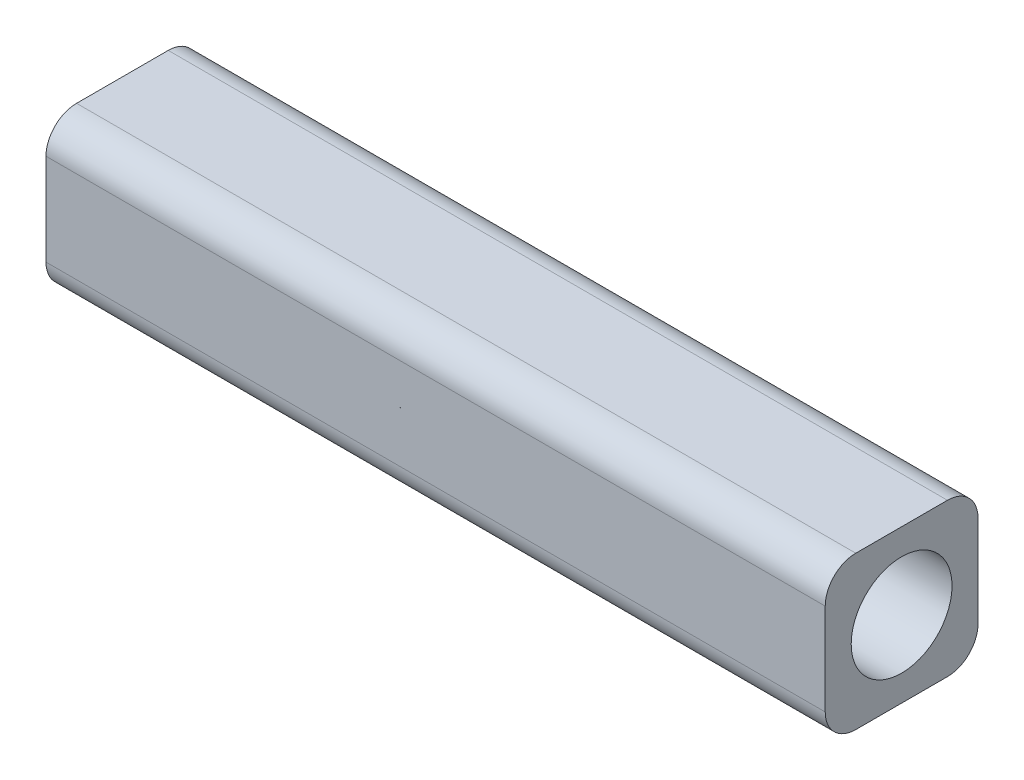
ISO-10303-21;
HEADER;
FILE_DESCRIPTION(('STEP AP214'),'2;1');
FILE_NAME('part.step','',(''),(''),'','','');
FILE_SCHEMA(('AUTOMOTIVE_DESIGN { 1 0 10303 214 1 1 1 1 }'));
ENDSEC;
DATA;
#1=APPLICATION_CONTEXT('core data for automotive mechanical design processes');
#2=APPLICATION_PROTOCOL_DEFINITION('international standard','automotive_design',2000,#1);
#3=PRODUCT_CONTEXT('',#1,'mechanical');
#4=PRODUCT('Part','Part','',(#3));
#5=PRODUCT_RELATED_PRODUCT_CATEGORY('part','',(#4));
#6=PRODUCT_DEFINITION_FORMATION('','',#4);
#7=PRODUCT_DEFINITION_CONTEXT('part definition',#1,'design');
#8=PRODUCT_DEFINITION('design','',#6,#7);
#9=PRODUCT_DEFINITION_SHAPE('','',#8);
#10=(LENGTH_UNIT() NAMED_UNIT(*) SI_UNIT(.MILLI.,.METRE.));
#11=(NAMED_UNIT(*) PLANE_ANGLE_UNIT() SI_UNIT($,.RADIAN.));
#12=(NAMED_UNIT(*) SI_UNIT($,.STERADIAN.) SOLID_ANGLE_UNIT());
#13=UNCERTAINTY_MEASURE_WITH_UNIT(LENGTH_MEASURE(1.E-05),#10,'distance_accuracy_value','');
#14=(GEOMETRIC_REPRESENTATION_CONTEXT(3) GLOBAL_UNCERTAINTY_ASSIGNED_CONTEXT((#13)) GLOBAL_UNIT_ASSIGNED_CONTEXT((#10,
#11,#12)) REPRESENTATION_CONTEXT('',''));
#15=CARTESIAN_POINT('',(0.,0.,0.));
#16=DIRECTION('',(0.,0.,1.));
#17=DIRECTION('',(1.,0.,0.));
#18=AXIS2_PLACEMENT_3D('',#15,#16,#17);
#19=CARTESIAN_POINT('',(12.75,5.,2.5));
#20=DIRECTION('',(-1.,0.,0.));
#21=DIRECTION('',(0.,0.,1.));
#22=AXIS2_PLACEMENT_3D('',#19,#20,#21);
#23=PLANE('',#22);
#24=CARTESIAN_POINT('',(12.75,2.5,0.));
#25=DIRECTION('',(-1.,0.,0.));
#26=DIRECTION('',(0.,0.,1.));
#27=AXIS2_PLACEMENT_3D('',#24,#25,#26);
#28=CIRCLE('',#27,1.65);
#29=CARTESIAN_POINT('',(12.75,2.5,1.65));
#30=VERTEX_POINT('',#29);
#31=EDGE_CURVE('E165',#30,#30,#28,.T.);
#32=ORIENTED_EDGE('',*,*,#31,.T.);
#33=EDGE_LOOP('',(#32));
#34=FACE_BOUND('',#33,.T.);
#35=DIRECTION('',(0.,0.,-1.));
#36=VECTOR('',#35,1.);
#37=CARTESIAN_POINT('',(12.75,0.,2.5));
#38=LINE('',#37,#36);
#39=CARTESIAN_POINT('',(12.75,0.,1.5));
#40=VERTEX_POINT('',#39);
#41=CARTESIAN_POINT('',(12.75,0.,-1.5));
#42=VERTEX_POINT('',#41);
#43=EDGE_CURVE('E162',#40,#42,#38,.T.);
#44=ORIENTED_EDGE('',*,*,#43,.T.);
#45=CARTESIAN_POINT('',(12.75,1.,-1.5));
#46=DIRECTION('',(-1.,0.,0.));
#47=DIRECTION('',(0.,0.,1.));
#48=AXIS2_PLACEMENT_3D('',#45,#46,#47);
#49=CIRCLE('',#48,1.);
#50=CARTESIAN_POINT('',(12.75,1.,-2.5));
#51=VERTEX_POINT('',#50);
#52=EDGE_CURVE('E143',#42,#51,#49,.F.);
#53=ORIENTED_EDGE('',*,*,#52,.T.);
#54=DIRECTION('',(0.,-1.,0.));
#55=VECTOR('',#54,1.);
#56=CARTESIAN_POINT('',(12.75,5.,-2.5));
#57=LINE('',#56,#55);
#58=CARTESIAN_POINT('',(12.75,4.,-2.5));
#59=VERTEX_POINT('',#58);
#60=EDGE_CURVE('E122',#59,#51,#57,.T.);
#61=ORIENTED_EDGE('',*,*,#60,.F.);
#62=CARTESIAN_POINT('',(12.75,4.,-1.5));
#63=DIRECTION('',(-1.,0.,0.));
#64=DIRECTION('',(0.,0.,1.));
#65=AXIS2_PLACEMENT_3D('',#62,#63,#64);
#66=CIRCLE('',#65,1.);
#67=CARTESIAN_POINT('',(12.75,5.,-1.5));
#68=VERTEX_POINT('',#67);
#69=EDGE_CURVE('E127',#59,#68,#66,.F.);
#70=ORIENTED_EDGE('',*,*,#69,.T.);
#71=DIRECTION('',(0.,0.,-1.));
#72=VECTOR('',#71,1.);
#73=CARTESIAN_POINT('',(12.75,5.,2.5));
#74=LINE('',#73,#72);
#75=CARTESIAN_POINT('',(12.75,5.,1.5));
#76=VERTEX_POINT('',#75);
#77=EDGE_CURVE('E153',#76,#68,#74,.T.);
#78=ORIENTED_EDGE('',*,*,#77,.F.);
#79=CARTESIAN_POINT('',(12.75,4.,1.5));
#80=DIRECTION('',(-1.,0.,0.));
#81=DIRECTION('',(0.,0.,1.));
#82=AXIS2_PLACEMENT_3D('',#79,#80,#81);
#83=CIRCLE('',#82,1.);
#84=CARTESIAN_POINT('',(12.75,4.,2.5));
#85=VERTEX_POINT('',#84);
#86=EDGE_CURVE('E58',#76,#85,#83,.F.);
#87=ORIENTED_EDGE('',*,*,#86,.T.);
#88=DIRECTION('',(0.,-1.,0.));
#89=VECTOR('',#88,1.);
#90=CARTESIAN_POINT('',(12.75,5.,2.5));
#91=LINE('',#90,#89);
#92=CARTESIAN_POINT('',(12.75,1.,2.5));
#93=VERTEX_POINT('',#92);
#94=EDGE_CURVE('E159',#85,#93,#91,.T.);
#95=ORIENTED_EDGE('',*,*,#94,.T.);
#96=CARTESIAN_POINT('',(12.75,1.,1.5));
#97=DIRECTION('',(-1.,0.,0.));
#98=DIRECTION('',(0.,0.,1.));
#99=AXIS2_PLACEMENT_3D('',#96,#97,#98);
#100=CIRCLE('',#99,1.);
#101=EDGE_CURVE('E50',#93,#40,#100,.F.);
#102=ORIENTED_EDGE('',*,*,#101,.T.);
#103=EDGE_LOOP('',(#44,#53,#61,#70,#78,#87,#95,#102));
#104=FACE_BOUND('',#103,.T.);
#105=ADVANCED_FACE('F35',(#34,#104),#23,.F.);
#106=CARTESIAN_POINT('',(-12.75,5.,-2.5));
#107=DIRECTION('',(0.,0.,1.));
#108=DIRECTION('',(1.,0.,0.));
#109=AXIS2_PLACEMENT_3D('',#106,#107,#108);
#110=PLANE('',#109);
#111=ORIENTED_EDGE('',*,*,#60,.T.);
#112=DIRECTION('',(-1.,0.,0.));
#113=VECTOR('',#112,1.);
#114=CARTESIAN_POINT('',(-12.75,1.,-2.5));
#115=LINE('',#114,#113);
#116=CARTESIAN_POINT('',(-12.75,1.,-2.5));
#117=VERTEX_POINT('',#116);
#118=EDGE_CURVE('E121',#51,#117,#115,.T.);
#119=ORIENTED_EDGE('',*,*,#118,.T.);
#120=DIRECTION('',(0.,-1.,0.));
#121=VECTOR('',#120,1.);
#122=CARTESIAN_POINT('',(-12.75,5.,-2.5));
#123=LINE('',#122,#121);
#124=CARTESIAN_POINT('',(-12.75,4.,-2.5));
#125=VERTEX_POINT('',#124);
#126=EDGE_CURVE('E105',#125,#117,#123,.T.);
#127=ORIENTED_EDGE('',*,*,#126,.F.);
#128=DIRECTION('',(-1.,0.,0.));
#129=VECTOR('',#128,1.);
#130=CARTESIAN_POINT('',(-12.75,4.,-2.5));
#131=LINE('',#130,#129);
#132=EDGE_CURVE('E118',#125,#59,#131,.F.);
#133=ORIENTED_EDGE('',*,*,#132,.T.);
#134=EDGE_LOOP('',(#111,#119,#127,#133));
#135=FACE_BOUND('',#134,.T.);
#136=ADVANCED_FACE('F117',(#135),#110,.F.);
#137=CARTESIAN_POINT('',(-12.75,5.,2.5));
#138=DIRECTION('',(1.,0.,0.));
#139=DIRECTION('',(0.,0.,-1.));
#140=AXIS2_PLACEMENT_3D('',#137,#138,#139);
#141=PLANE('',#140);
#142=CARTESIAN_POINT('',(-12.75,2.5,0.));
#143=DIRECTION('',(1.,0.,0.));
#144=DIRECTION('',(0.,0.,-1.));
#145=AXIS2_PLACEMENT_3D('',#142,#143,#144);
#146=CIRCLE('',#145,1.65);
#147=CARTESIAN_POINT('',(-12.75,2.5,-1.65));
#148=VERTEX_POINT('',#147);
#149=EDGE_CURVE('E278',#148,#148,#146,.T.);
#150=ORIENTED_EDGE('',*,*,#149,.T.);
#151=EDGE_LOOP('',(#150));
#152=FACE_BOUND('',#151,.T.);
#153=ORIENTED_EDGE('',*,*,#126,.T.);
#154=CARTESIAN_POINT('',(-12.75,1.,-1.5));
#155=DIRECTION('',(1.,0.,0.));
#156=DIRECTION('',(0.,0.,-1.));
#157=AXIS2_PLACEMENT_3D('',#154,#155,#156);
#158=CIRCLE('',#157,1.);
#159=CARTESIAN_POINT('',(-12.75,0.,-1.5));
#160=VERTEX_POINT('',#159);
#161=EDGE_CURVE('E134',#117,#160,#158,.F.);
#162=ORIENTED_EDGE('',*,*,#161,.T.);
#163=DIRECTION('',(0.,0.,1.));
#164=VECTOR('',#163,1.);
#165=CARTESIAN_POINT('',(-12.75,0.,2.5));
#166=LINE('',#165,#164);
#167=CARTESIAN_POINT('',(-12.75,0.,1.5));
#168=VERTEX_POINT('',#167);
#169=EDGE_CURVE('E157',#160,#168,#166,.T.);
#170=ORIENTED_EDGE('',*,*,#169,.T.);
#171=CARTESIAN_POINT('',(-12.75,1.,1.5));
#172=DIRECTION('',(1.,0.,0.));
#173=DIRECTION('',(0.,0.,-1.));
#174=AXIS2_PLACEMENT_3D('',#171,#172,#173);
#175=CIRCLE('',#174,1.);
#176=CARTESIAN_POINT('',(-12.75,1.,2.5));
#177=VERTEX_POINT('',#176);
#178=EDGE_CURVE('E111',#168,#177,#175,.F.);
#179=ORIENTED_EDGE('',*,*,#178,.T.);
#180=DIRECTION('',(0.,-1.,0.));
#181=VECTOR('',#180,1.);
#182=CARTESIAN_POINT('',(-12.75,5.,2.5));
#183=LINE('',#182,#181);
#184=CARTESIAN_POINT('',(-12.75,4.,2.5));
#185=VERTEX_POINT('',#184);
#186=EDGE_CURVE('E123',#185,#177,#183,.T.);
#187=ORIENTED_EDGE('',*,*,#186,.F.);
#188=CARTESIAN_POINT('',(-12.75,4.,1.5));
#189=DIRECTION('',(1.,0.,0.));
#190=DIRECTION('',(0.,0.,-1.));
#191=AXIS2_PLACEMENT_3D('',#188,#189,#190);
#192=CIRCLE('',#191,1.);
#193=CARTESIAN_POINT('',(-12.75,5.,1.5));
#194=VERTEX_POINT('',#193);
#195=EDGE_CURVE('E112',#185,#194,#192,.F.);
#196=ORIENTED_EDGE('',*,*,#195,.T.);
#197=DIRECTION('',(0.,0.,1.));
#198=VECTOR('',#197,1.);
#199=CARTESIAN_POINT('',(-12.75,5.,2.5));
#200=LINE('',#199,#198);
#201=CARTESIAN_POINT('',(-12.75,5.,-1.5));
#202=VERTEX_POINT('',#201);
#203=EDGE_CURVE('E107',#202,#194,#200,.T.);
#204=ORIENTED_EDGE('',*,*,#203,.F.);
#205=CARTESIAN_POINT('',(-12.75,4.,-1.5));
#206=DIRECTION('',(1.,0.,0.));
#207=DIRECTION('',(0.,0.,-1.));
#208=AXIS2_PLACEMENT_3D('',#205,#206,#207);
#209=CIRCLE('',#208,1.);
#210=EDGE_CURVE('E102',#202,#125,#209,.F.);
#211=ORIENTED_EDGE('',*,*,#210,.T.);
#212=EDGE_LOOP('',(#153,#162,#170,#179,#187,#196,#204,#211));
#213=FACE_BOUND('',#212,.T.);
#214=ADVANCED_FACE('F104',(#152,#213),#141,.F.);
#215=CARTESIAN_POINT('',(-12.75,5.,2.5));
#216=DIRECTION('',(0.,0.,-1.));
#217=DIRECTION('',(-1.,0.,0.));
#218=AXIS2_PLACEMENT_3D('',#215,#216,#217);
#219=PLANE('',#218);
#220=ORIENTED_EDGE('',*,*,#186,.T.);
#221=DIRECTION('',(1.,0.,0.));
#222=VECTOR('',#221,1.);
#223=CARTESIAN_POINT('',(12.75,1.,2.5));
#224=LINE('',#223,#222);
#225=EDGE_CURVE('E147',#177,#93,#224,.T.);
#226=ORIENTED_EDGE('',*,*,#225,.T.);
#227=ORIENTED_EDGE('',*,*,#94,.F.);
#228=DIRECTION('',(1.,0.,0.));
#229=VECTOR('',#228,1.);
#230=CARTESIAN_POINT('',(-12.75,4.,2.5));
#231=LINE('',#230,#229);
#232=EDGE_CURVE('E145',#85,#185,#231,.F.);
#233=ORIENTED_EDGE('',*,*,#232,.T.);
#234=EDGE_LOOP('',(#220,#226,#227,#233));
#235=FACE_BOUND('',#234,.T.);
#236=ADVANCED_FACE('F173',(#235),#219,.F.);
#237=CARTESIAN_POINT('',(0.,5.,0.));
#238=DIRECTION('',(0.,-1.,0.));
#239=DIRECTION('',(0.,0.,-1.));
#240=AXIS2_PLACEMENT_3D('',#237,#238,#239);
#241=PLANE('',#240);
#242=ORIENTED_EDGE('',*,*,#77,.T.);
#243=DIRECTION('',(-1.,0.,0.));
#244=VECTOR('',#243,1.);
#245=CARTESIAN_POINT('',(0.,5.,-1.5));
#246=LINE('',#245,#244);
#247=EDGE_CURVE('E11',#68,#202,#246,.T.);
#248=ORIENTED_EDGE('',*,*,#247,.T.);
#249=ORIENTED_EDGE('',*,*,#203,.T.);
#250=DIRECTION('',(1.,0.,0.));
#251=VECTOR('',#250,1.);
#252=CARTESIAN_POINT('',(0.,5.,1.5));
#253=LINE('',#252,#251);
#254=EDGE_CURVE('E43',#194,#76,#253,.T.);
#255=ORIENTED_EDGE('',*,*,#254,.T.);
#256=EDGE_LOOP('',(#242,#248,#249,#255));
#257=FACE_BOUND('',#256,.T.);
#258=ADVANCED_FACE('F152',(#257),#241,.F.);
#259=CARTESIAN_POINT('',(0.,0.,0.));
#260=DIRECTION('',(0.,-1.,0.));
#261=DIRECTION('',(0.,0.,-1.));
#262=AXIS2_PLACEMENT_3D('',#259,#260,#261);
#263=PLANE('',#262);
#264=ORIENTED_EDGE('',*,*,#169,.F.);
#265=DIRECTION('',(-1.,0.,0.));
#266=VECTOR('',#265,1.);
#267=CARTESIAN_POINT('',(12.75,0.,-1.5));
#268=LINE('',#267,#266);
#269=EDGE_CURVE('E138',#160,#42,#268,.F.);
#270=ORIENTED_EDGE('',*,*,#269,.T.);
#271=ORIENTED_EDGE('',*,*,#43,.F.);
#272=DIRECTION('',(1.,0.,0.));
#273=VECTOR('',#272,1.);
#274=CARTESIAN_POINT('',(-12.75,0.,1.5));
#275=LINE('',#274,#273);
#276=EDGE_CURVE('E136',#40,#168,#275,.F.);
#277=ORIENTED_EDGE('',*,*,#276,.T.);
#278=EDGE_LOOP('',(#264,#270,#271,#277));
#279=FACE_BOUND('',#278,.T.);
#280=ADVANCED_FACE('F180',(#279),#263,.T.);
#281=CARTESIAN_POINT('',(-12.75,2.5,0.));
#282=DIRECTION('',(1.,0.,0.));
#283=DIRECTION('',(0.,0.,-1.));
#284=AXIS2_PLACEMENT_3D('',#281,#282,#283);
#285=CYLINDRICAL_SURFACE('',#284,1.65);
#286=ORIENTED_EDGE('',*,*,#149,.F.);
#287=EDGE_LOOP('',(#286));
#288=FACE_BOUND('',#287,.T.);
#289=ORIENTED_EDGE('',*,*,#31,.F.);
#290=EDGE_LOOP('',(#289));
#291=FACE_BOUND('',#290,.T.);
#292=ADVANCED_FACE('F201',(#288,#291),#285,.F.);
#293=CARTESIAN_POINT('',(-12.75,1.,-1.5));
#294=DIRECTION('',(1.,0.,0.));
#295=DIRECTION('',(0.,0.,-1.));
#296=AXIS2_PLACEMENT_3D('',#293,#294,#295);
#297=CYLINDRICAL_SURFACE('',#296,1.);
#298=ORIENTED_EDGE('',*,*,#52,.F.);
#299=ORIENTED_EDGE('',*,*,#269,.F.);
#300=ORIENTED_EDGE('',*,*,#161,.F.);
#301=ORIENTED_EDGE('',*,*,#118,.F.);
#302=EDGE_LOOP('',(#298,#299,#300,#301));
#303=FACE_BOUND('',#302,.T.);
#304=ADVANCED_FACE('F184',(#303),#297,.T.);
#305=CARTESIAN_POINT('',(-12.75,1.,1.5));
#306=DIRECTION('',(-1.,0.,0.));
#307=DIRECTION('',(0.,0.,1.));
#308=AXIS2_PLACEMENT_3D('',#305,#306,#307);
#309=CYLINDRICAL_SURFACE('',#308,1.);
#310=ORIENTED_EDGE('',*,*,#178,.F.);
#311=ORIENTED_EDGE('',*,*,#276,.F.);
#312=ORIENTED_EDGE('',*,*,#101,.F.);
#313=ORIENTED_EDGE('',*,*,#225,.F.);
#314=EDGE_LOOP('',(#310,#311,#312,#313));
#315=FACE_BOUND('',#314,.T.);
#316=ADVANCED_FACE('F176',(#315),#309,.T.);
#317=CARTESIAN_POINT('',(0.,4.,-1.5));
#318=DIRECTION('',(-1.,0.,0.));
#319=DIRECTION('',(0.,0.,1.));
#320=AXIS2_PLACEMENT_3D('',#317,#318,#319);
#321=CYLINDRICAL_SURFACE('',#320,1.);
#322=ORIENTED_EDGE('',*,*,#69,.F.);
#323=ORIENTED_EDGE('',*,*,#132,.F.);
#324=ORIENTED_EDGE('',*,*,#210,.F.);
#325=ORIENTED_EDGE('',*,*,#247,.F.);
#326=EDGE_LOOP('',(#322,#323,#324,#325));
#327=FACE_BOUND('',#326,.T.);
#328=ADVANCED_FACE('F126',(#327),#321,.T.);
#329=CARTESIAN_POINT('',(0.,4.,1.5));
#330=DIRECTION('',(1.,0.,0.));
#331=DIRECTION('',(0.,0.,-1.));
#332=AXIS2_PLACEMENT_3D('',#329,#330,#331);
#333=CYLINDRICAL_SURFACE('',#332,1.);
#334=ORIENTED_EDGE('',*,*,#195,.F.);
#335=ORIENTED_EDGE('',*,*,#232,.F.);
#336=ORIENTED_EDGE('',*,*,#86,.F.);
#337=ORIENTED_EDGE('',*,*,#254,.F.);
#338=EDGE_LOOP('',(#334,#335,#336,#337));
#339=FACE_BOUND('',#338,.T.);
#340=ADVANCED_FACE('F37',(#339),#333,.T.);
#341=CLOSED_SHELL('',(#105,#136,#214,#236,#258,#280,#292,#304,#316,#328,#340));
#342=MANIFOLD_SOLID_BREP('B2',#341);
#343=ADVANCED_BREP_SHAPE_REPRESENTATION('',(#18,#342),#14);
#344=SHAPE_DEFINITION_REPRESENTATION(#9,#343);
ENDSEC;
END-ISO-10303-21;
